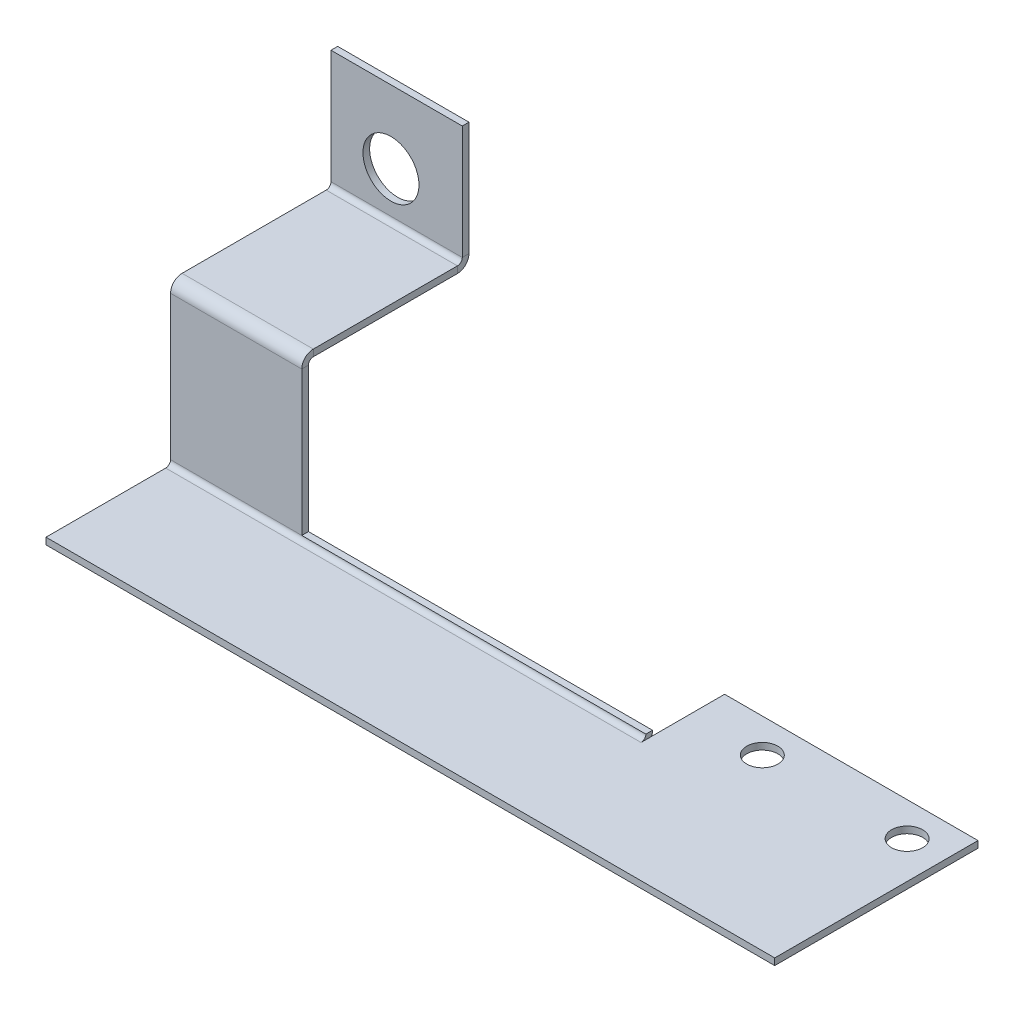
ISO-10303-21;
HEADER;
FILE_DESCRIPTION(('STEP AP214'),'2;1');
FILE_NAME('part.step','',(''),(''),'','','');
FILE_SCHEMA(('AUTOMOTIVE_DESIGN { 1 0 10303 214 1 1 1 1 }'));
ENDSEC;
DATA;
#1=APPLICATION_CONTEXT('core data for automotive mechanical design processes');
#2=APPLICATION_PROTOCOL_DEFINITION('international standard','automotive_design',2000,#1);
#3=PRODUCT_CONTEXT('',#1,'mechanical');
#4=PRODUCT('Part','Part','',(#3));
#5=PRODUCT_RELATED_PRODUCT_CATEGORY('part','',(#4));
#6=PRODUCT_DEFINITION_FORMATION('','',#4);
#7=PRODUCT_DEFINITION_CONTEXT('part definition',#1,'design');
#8=PRODUCT_DEFINITION('design','',#6,#7);
#9=PRODUCT_DEFINITION_SHAPE('','',#8);
#10=(LENGTH_UNIT() NAMED_UNIT(*) SI_UNIT(.MILLI.,.METRE.));
#11=(NAMED_UNIT(*) PLANE_ANGLE_UNIT() SI_UNIT($,.RADIAN.));
#12=(NAMED_UNIT(*) SI_UNIT($,.STERADIAN.) SOLID_ANGLE_UNIT());
#13=UNCERTAINTY_MEASURE_WITH_UNIT(LENGTH_MEASURE(1.E-05),#10,'distance_accuracy_value','');
#14=(GEOMETRIC_REPRESENTATION_CONTEXT(3) GLOBAL_UNCERTAINTY_ASSIGNED_CONTEXT((#13)) GLOBAL_UNIT_ASSIGNED_CONTEXT((#10,
#11,#12)) REPRESENTATION_CONTEXT('',''));
#15=CARTESIAN_POINT('',(0.,0.,0.));
#16=DIRECTION('',(0.,0.,1.));
#17=DIRECTION('',(1.,0.,0.));
#18=AXIS2_PLACEMENT_3D('',#15,#16,#17);
#19=CARTESIAN_POINT('',(-110.7186,0.736599999999986,-18.1864));
#20=DIRECTION('',(-1.,0.,0.));
#21=DIRECTION('',(0.,0.,-1.));
#22=AXIS2_PLACEMENT_3D('',#19,#20,#21);
#23=CYLINDRICAL_SURFACE('',#22,1.75260000000001);
#24=DIRECTION('',(-1.,0.,0.));
#25=VECTOR('',#24,1.);
#26=CARTESIAN_POINT('',(0.,0.736600000000004,-19.939));
#27=LINE('',#26,#25);
#28=CARTESIAN_POINT('',(-90.7796,0.736599999999991,-19.939));
#29=VERTEX_POINT('',#28);
#30=CARTESIAN_POINT('',(-38.49878,0.736600000000003,-19.939));
#31=VERTEX_POINT('',#30);
#32=EDGE_CURVE('E365',#29,#31,#27,.F.);
#33=ORIENTED_EDGE('',*,*,#32,.T.);
#34=CARTESIAN_POINT('',(-38.49878,0.736599999999991,-18.1864));
#35=DIRECTION('',(1.,0.,0.));
#36=DIRECTION('',(0.,0.,-1.));
#37=AXIS2_PLACEMENT_3D('',#34,#35,#36);
#38=CIRCLE('',#37,1.75260000000001);
#39=CARTESIAN_POINT('',(-38.49878,0.,-19.7766915455979));
#40=VERTEX_POINT('',#39);
#41=EDGE_CURVE('E115',#31,#40,#38,.F.);
#42=ORIENTED_EDGE('',*,*,#41,.T.);
#43=CARTESIAN_POINT('',(-38.49878,-1.01600000000001,-18.1864));
#44=VERTEX_POINT('',#43);
#45=EDGE_CURVE('E268',#40,#44,#38,.F.);
#46=ORIENTED_EDGE('',*,*,#45,.T.);
#47=DIRECTION('',(-1.,0.,0.));
#48=VECTOR('',#47,1.);
#49=CARTESIAN_POINT('',(-110.7186,-1.01600000000002,-18.1864));
#50=LINE('',#49,#48);
#51=CARTESIAN_POINT('',(-110.7186,-1.01600000000002,-18.1864));
#52=VERTEX_POINT('',#51);
#53=EDGE_CURVE('E395',#52,#44,#50,.F.);
#54=ORIENTED_EDGE('',*,*,#53,.F.);
#55=CARTESIAN_POINT('',(-110.7186,0.736599999999986,-18.1864));
#56=DIRECTION('',(-1.,0.,0.));
#57=DIRECTION('',(0.,-1.,0.));
#58=AXIS2_PLACEMENT_3D('',#55,#56,#57);
#59=CIRCLE('',#58,1.75260000000001);
#60=CARTESIAN_POINT('',(-110.7186,0.736600000000001,-19.939));
#61=VERTEX_POINT('',#60);
#62=EDGE_CURVE('E398',#61,#52,#59,.T.);
#63=ORIENTED_EDGE('',*,*,#62,.F.);
#64=DIRECTION('',(-1.,0.,0.));
#65=VECTOR('',#64,1.);
#66=CARTESIAN_POINT('',(0.,0.736600000000004,-19.939));
#67=LINE('',#66,#65);
#68=EDGE_CURVE('E387',#61,#29,#67,.F.);
#69=ORIENTED_EDGE('',*,*,#68,.T.);
#70=EDGE_LOOP('',(#33,#42,#46,#54,#63,#69));
#71=FACE_BOUND('',#70,.T.);
#72=ADVANCED_FACE('F98',(#71),#23,.T.);
#73=CARTESIAN_POINT('',(-110.7186,0.736599999999986,-18.1864));
#74=DIRECTION('',(-1.,0.,0.));
#75=DIRECTION('',(0.,0.,-1.));
#76=AXIS2_PLACEMENT_3D('',#73,#74,#75);
#77=CYLINDRICAL_SURFACE('',#76,0.736600000000007);
#78=CARTESIAN_POINT('',(-38.49878,0.736599999999991,-18.1864));
#79=DIRECTION('',(1.,0.,0.));
#80=DIRECTION('',(0.,0.,-1.));
#81=AXIS2_PLACEMENT_3D('',#78,#79,#80);
#82=CIRCLE('',#81,0.736600000000007);
#83=CARTESIAN_POINT('',(-38.49878,0.736599999999987,-18.923));
#84=VERTEX_POINT('',#83);
#85=CARTESIAN_POINT('',(-38.49878,0.,-18.1864));
#86=VERTEX_POINT('',#85);
#87=EDGE_CURVE('E265',#84,#86,#82,.F.);
#88=ORIENTED_EDGE('',*,*,#87,.F.);
#89=DIRECTION('',(-1.,0.,0.));
#90=VECTOR('',#89,1.);
#91=CARTESIAN_POINT('',(0.,0.736599999999997,-18.923));
#92=LINE('',#91,#90);
#93=CARTESIAN_POINT('',(-90.7796,0.736599999999991,-18.923));
#94=VERTEX_POINT('',#93);
#95=EDGE_CURVE('E393',#84,#94,#92,.T.);
#96=ORIENTED_EDGE('',*,*,#95,.T.);
#97=CARTESIAN_POINT('',(-110.7186,0.736599999999983,-18.923));
#98=VERTEX_POINT('',#97);
#99=EDGE_CURVE('E379',#94,#98,#92,.T.);
#100=ORIENTED_EDGE('',*,*,#99,.T.);
#101=CARTESIAN_POINT('',(-110.7186,0.736599999999986,-18.1864));
#102=DIRECTION('',(-1.,0.,0.));
#103=DIRECTION('',(0.,-1.,0.));
#104=AXIS2_PLACEMENT_3D('',#101,#102,#103);
#105=CIRCLE('',#104,0.736600000000007);
#106=CARTESIAN_POINT('',(-110.7186,0.,-18.1864));
#107=VERTEX_POINT('',#106);
#108=EDGE_CURVE('E383',#98,#107,#105,.T.);
#109=ORIENTED_EDGE('',*,*,#108,.T.);
#110=DIRECTION('',(-1.,0.,0.));
#111=VECTOR('',#110,1.);
#112=CARTESIAN_POINT('',(-110.7186,0.,-18.1864));
#113=LINE('',#112,#111);
#114=EDGE_CURVE('E401',#107,#86,#113,.F.);
#115=ORIENTED_EDGE('',*,*,#114,.T.);
#116=EDGE_LOOP('',(#88,#96,#100,#109,#115));
#117=FACE_BOUND('',#116,.T.);
#118=ADVANCED_FACE('F425',(#117),#77,.F.);
#119=CARTESIAN_POINT('',(0.,0.736599999999984,-19.9400000000001));
#120=DIRECTION('',(0.,-1.,0.));
#121=DIRECTION('',(1.,0.,0.));
#122=AXIS2_PLACEMENT_3D('',#119,#120,#121);
#123=PLANE('',#122);
#124=DIRECTION('',(0.,0.,1.));
#125=VECTOR('',#124,1.);
#126=CARTESIAN_POINT('',(-38.49878,0.736599999999987,-19.9400000000001));
#127=LINE('',#126,#125);
#128=EDGE_CURVE('E106',#31,#84,#127,.T.);
#129=ORIENTED_EDGE('',*,*,#128,.F.);
#130=ORIENTED_EDGE('',*,*,#32,.F.);
#131=DIRECTION('',(0.,0.,1.));
#132=VECTOR('',#131,1.);
#133=CARTESIAN_POINT('',(-90.7796,0.736599999999991,-19.9400000000001));
#134=LINE('',#133,#132);
#135=EDGE_CURVE('E376',#29,#94,#134,.T.);
#136=ORIENTED_EDGE('',*,*,#135,.T.);
#137=ORIENTED_EDGE('',*,*,#95,.F.);
#138=EDGE_LOOP('',(#129,#130,#136,#137));
#139=FACE_BOUND('',#138,.T.);
#140=ADVANCED_FACE('F426',(#139),#123,.F.);
#141=CARTESIAN_POINT('',(-110.7186,24.384,-19.9390000000001));
#142=DIRECTION('',(1.,0.,0.));
#143=DIRECTION('',(0.,1.,0.));
#144=AXIS2_PLACEMENT_3D('',#141,#142,#143);
#145=PLANE('',#144);
#146=DIRECTION('',(0.,-1.,0.));
#147=VECTOR('',#146,1.);
#148=CARTESIAN_POINT('',(-110.7186,24.384,-42.5704000000001));
#149=LINE('',#148,#147);
#150=CARTESIAN_POINT('',(-110.7186,24.384,-42.5704000000001));
#151=VERTEX_POINT('',#150);
#152=CARTESIAN_POINT('',(-110.7186,23.368,-42.5704000000001));
#153=VERTEX_POINT('',#152);
#154=EDGE_CURVE('E308',#151,#153,#149,.T.);
#155=ORIENTED_EDGE('',*,*,#154,.T.);
#156=DIRECTION('',(0.,0.,-1.));
#157=VECTOR('',#156,1.);
#158=CARTESIAN_POINT('',(-110.7186,23.368,-19.9390000000001));
#159=LINE('',#158,#157);
#160=CARTESIAN_POINT('',(-110.7186,23.368,-20.6756000000001));
#161=VERTEX_POINT('',#160);
#162=EDGE_CURVE('E333',#153,#161,#159,.F.);
#163=ORIENTED_EDGE('',*,*,#162,.T.);
#164=DIRECTION('',(0.,-1.,0.));
#165=VECTOR('',#164,1.);
#166=CARTESIAN_POINT('',(-110.7186,24.384,-20.6756000000001));
#167=LINE('',#166,#165);
#168=CARTESIAN_POINT('',(-110.7186,24.384,-20.6756000000001));
#169=VERTEX_POINT('',#168);
#170=EDGE_CURVE('E321',#161,#169,#167,.F.);
#171=ORIENTED_EDGE('',*,*,#170,.T.);
#172=DIRECTION('',(0.,0.,1.));
#173=VECTOR('',#172,1.);
#174=CARTESIAN_POINT('',(-110.7186,24.384,0.));
#175=LINE('',#174,#173);
#176=EDGE_CURVE('E328',#151,#169,#175,.T.);
#177=ORIENTED_EDGE('',*,*,#176,.F.);
#178=EDGE_LOOP('',(#155,#163,#171,#177));
#179=FACE_BOUND('',#178,.T.);
#180=ADVANCED_FACE('F599',(#179),#145,.F.);
#181=CARTESIAN_POINT('',(-90.7796,24.384,-44.3230000000001));
#182=DIRECTION('',(-1.,0.,0.));
#183=DIRECTION('',(0.,-1.,0.));
#184=AXIS2_PLACEMENT_3D('',#181,#182,#183);
#185=PLANE('',#184);
#186=DIRECTION('',(0.,-1.,0.));
#187=VECTOR('',#186,1.);
#188=CARTESIAN_POINT('',(-90.7796,24.384,-42.5704000000001));
#189=LINE('',#188,#187);
#190=CARTESIAN_POINT('',(-90.7796,24.384,-42.5704000000001));
#191=VERTEX_POINT('',#190);
#192=CARTESIAN_POINT('',(-90.7796,23.368,-42.5704000000001));
#193=VERTEX_POINT('',#192);
#194=EDGE_CURVE('E318',#191,#193,#189,.T.);
#195=ORIENTED_EDGE('',*,*,#194,.F.);
#196=DIRECTION('',(0.,0.,-1.));
#197=VECTOR('',#196,1.);
#198=CARTESIAN_POINT('',(-90.7796,24.384,0.));
#199=LINE('',#198,#197);
#200=CARTESIAN_POINT('',(-90.7796,24.384,-20.6756000000001));
#201=VERTEX_POINT('',#200);
#202=EDGE_CURVE('E324',#201,#191,#199,.T.);
#203=ORIENTED_EDGE('',*,*,#202,.F.);
#204=DIRECTION('',(0.,-1.,0.));
#205=VECTOR('',#204,1.);
#206=CARTESIAN_POINT('',(-90.7796,23.368,-20.6756000000001));
#207=LINE('',#206,#205);
#208=CARTESIAN_POINT('',(-90.7796,23.368,-20.6756000000001));
#209=VERTEX_POINT('',#208);
#210=EDGE_CURVE('E338',#209,#201,#207,.F.);
#211=ORIENTED_EDGE('',*,*,#210,.F.);
#212=DIRECTION('',(0.,0.,1.));
#213=VECTOR('',#212,1.);
#214=CARTESIAN_POINT('',(-90.7796,23.368,-44.3230000000001));
#215=LINE('',#214,#213);
#216=EDGE_CURVE('E330',#209,#193,#215,.F.);
#217=ORIENTED_EDGE('',*,*,#216,.T.);
#218=EDGE_LOOP('',(#195,#203,#211,#217));
#219=FACE_BOUND('',#218,.T.);
#220=ADVANCED_FACE('F662',(#219),#185,.F.);
#221=CARTESIAN_POINT('',(0.,24.384,0.));
#222=DIRECTION('',(0.,-1.,0.));
#223=DIRECTION('',(0.,0.,-1.));
#224=AXIS2_PLACEMENT_3D('',#221,#222,#223);
#225=PLANE('',#224);
#226=DIRECTION('',(-1.,0.,0.));
#227=VECTOR('',#226,1.);
#228=CARTESIAN_POINT('',(-110.7186,24.384,-42.5704000000001));
#229=LINE('',#228,#227);
#230=EDGE_CURVE('E314',#151,#191,#229,.F.);
#231=ORIENTED_EDGE('',*,*,#230,.F.);
#232=ORIENTED_EDGE('',*,*,#176,.T.);
#233=DIRECTION('',(1.,0.,0.));
#234=VECTOR('',#233,1.);
#235=CARTESIAN_POINT('',(-110.7186,24.384,-20.6756000000001));
#236=LINE('',#235,#234);
#237=EDGE_CURVE('E335',#201,#169,#236,.F.);
#238=ORIENTED_EDGE('',*,*,#237,.F.);
#239=ORIENTED_EDGE('',*,*,#202,.T.);
#240=EDGE_LOOP('',(#231,#232,#238,#239));
#241=FACE_BOUND('',#240,.T.);
#242=ADVANCED_FACE('F658',(#241),#225,.F.);
#243=CARTESIAN_POINT('',(0.,23.368,0.));
#244=DIRECTION('',(0.,-1.,0.));
#245=DIRECTION('',(0.,0.,-1.));
#246=AXIS2_PLACEMENT_3D('',#243,#244,#245);
#247=PLANE('',#246);
#248=ORIENTED_EDGE('',*,*,#162,.F.);
#249=DIRECTION('',(-1.,0.,0.));
#250=VECTOR('',#249,1.);
#251=CARTESIAN_POINT('',(-110.7186,23.368,-42.5704000000001));
#252=LINE('',#251,#250);
#253=EDGE_CURVE('E301',#153,#193,#252,.F.);
#254=ORIENTED_EDGE('',*,*,#253,.T.);
#255=ORIENTED_EDGE('',*,*,#216,.F.);
#256=DIRECTION('',(1.,0.,0.));
#257=VECTOR('',#256,1.);
#258=CARTESIAN_POINT('',(-110.7186,23.368,-20.6756000000001));
#259=LINE('',#258,#257);
#260=EDGE_CURVE('E341',#161,#209,#259,.T.);
#261=ORIENTED_EDGE('',*,*,#260,.F.);
#262=EDGE_LOOP('',(#248,#254,#255,#261));
#263=FACE_BOUND('',#262,.T.);
#264=ADVANCED_FACE('F661',(#263),#247,.T.);
#265=CARTESIAN_POINT('',(-110.7186,24.384,-19.9390000000001));
#266=DIRECTION('',(1.,0.,0.));
#267=DIRECTION('',(0.,0.,-1.));
#268=AXIS2_PLACEMENT_3D('',#265,#266,#267);
#269=PLANE('',#268);
#270=DIRECTION('',(0.,0.,1.));
#271=VECTOR('',#270,1.);
#272=CARTESIAN_POINT('',(-110.7186,22.6314,-19.9390000000001));
#273=LINE('',#272,#271);
#274=CARTESIAN_POINT('',(-110.7186,22.6314,-19.9390000000001));
#275=VERTEX_POINT('',#274);
#276=CARTESIAN_POINT('',(-110.7186,22.6314,-18.9230000000001));
#277=VERTEX_POINT('',#276);
#278=EDGE_CURVE('E362',#275,#277,#273,.T.);
#279=ORIENTED_EDGE('',*,*,#278,.F.);
#280=DIRECTION('',(0.,1.,0.));
#281=VECTOR('',#280,1.);
#282=CARTESIAN_POINT('',(-110.7186,0.,-19.939));
#283=LINE('',#282,#281);
#284=EDGE_CURVE('E380',#61,#275,#283,.T.);
#285=ORIENTED_EDGE('',*,*,#284,.F.);
#286=DIRECTION('',(0.,0.,1.));
#287=VECTOR('',#286,1.);
#288=CARTESIAN_POINT('',(-110.7186,0.736599999999993,-18.923));
#289=LINE('',#288,#287);
#290=EDGE_CURVE('E390',#98,#61,#289,.F.);
#291=ORIENTED_EDGE('',*,*,#290,.F.);
#292=DIRECTION('',(0.,-1.,0.));
#293=VECTOR('',#292,1.);
#294=CARTESIAN_POINT('',(-110.7186,24.384,-18.9230000000001));
#295=LINE('',#294,#293);
#296=EDGE_CURVE('E384',#98,#277,#295,.F.);
#297=ORIENTED_EDGE('',*,*,#296,.T.);
#298=EDGE_LOOP('',(#279,#285,#291,#297));
#299=FACE_BOUND('',#298,.T.);
#300=ADVANCED_FACE('F443',(#299),#269,.F.);
#301=CARTESIAN_POINT('',(0.,0.,-19.939));
#302=DIRECTION('',(0.,0.,1.));
#303=DIRECTION('',(0.,-1.,0.));
#304=AXIS2_PLACEMENT_3D('',#301,#302,#303);
#305=PLANE('',#304);
#306=DIRECTION('',(1.,0.,0.));
#307=VECTOR('',#306,1.);
#308=CARTESIAN_POINT('',(-90.7796,22.6314,-19.9390000000001));
#309=LINE('',#308,#307);
#310=CARTESIAN_POINT('',(-90.7796,22.6314,-19.9390000000001));
#311=VERTEX_POINT('',#310);
#312=EDGE_CURVE('E358',#311,#275,#309,.F.);
#313=ORIENTED_EDGE('',*,*,#312,.F.);
#314=DIRECTION('',(0.,1.,0.));
#315=VECTOR('',#314,1.);
#316=CARTESIAN_POINT('',(-90.7796,24.384,-19.9390000000001));
#317=LINE('',#316,#315);
#318=EDGE_CURVE('E370',#29,#311,#317,.T.);
#319=ORIENTED_EDGE('',*,*,#318,.F.);
#320=ORIENTED_EDGE('',*,*,#68,.F.);
#321=ORIENTED_EDGE('',*,*,#284,.T.);
#322=EDGE_LOOP('',(#313,#319,#320,#321));
#323=FACE_BOUND('',#322,.T.);
#324=ADVANCED_FACE('F446',(#323),#305,.F.);
#325=CARTESIAN_POINT('',(0.,0.,-18.923));
#326=DIRECTION('',(0.,0.,1.));
#327=DIRECTION('',(0.,-1.,0.));
#328=AXIS2_PLACEMENT_3D('',#325,#326,#327);
#329=PLANE('',#328);
#330=DIRECTION('',(0.,-1.,0.));
#331=VECTOR('',#330,1.);
#332=CARTESIAN_POINT('',(-90.7796,24.384,-18.923));
#333=LINE('',#332,#331);
#334=CARTESIAN_POINT('',(-90.7796,22.6314,-18.9230000000001));
#335=VERTEX_POINT('',#334);
#336=EDGE_CURVE('E373',#335,#94,#333,.T.);
#337=ORIENTED_EDGE('',*,*,#336,.F.);
#338=DIRECTION('',(1.,0.,0.));
#339=VECTOR('',#338,1.);
#340=CARTESIAN_POINT('',(-90.7796,22.6314,-18.9230000000001));
#341=LINE('',#340,#339);
#342=EDGE_CURVE('E345',#335,#277,#341,.F.);
#343=ORIENTED_EDGE('',*,*,#342,.T.);
#344=ORIENTED_EDGE('',*,*,#296,.F.);
#345=ORIENTED_EDGE('',*,*,#99,.F.);
#346=EDGE_LOOP('',(#337,#343,#344,#345));
#347=FACE_BOUND('',#346,.T.);
#348=ADVANCED_FACE('F433',(#347),#329,.T.);
#349=CARTESIAN_POINT('',(-90.7796,24.384,-19.9400000000001));
#350=DIRECTION('',(-1.,0.,0.));
#351=DIRECTION('',(0.,0.,1.));
#352=AXIS2_PLACEMENT_3D('',#349,#350,#351);
#353=PLANE('',#352);
#354=DIRECTION('',(0.,0.,1.));
#355=VECTOR('',#354,1.);
#356=CARTESIAN_POINT('',(-90.7796,22.6314,-19.9390000000001));
#357=LINE('',#356,#355);
#358=EDGE_CURVE('E352',#311,#335,#357,.T.);
#359=ORIENTED_EDGE('',*,*,#358,.T.);
#360=ORIENTED_EDGE('',*,*,#336,.T.);
#361=ORIENTED_EDGE('',*,*,#135,.F.);
#362=ORIENTED_EDGE('',*,*,#318,.T.);
#363=EDGE_LOOP('',(#359,#360,#361,#362));
#364=FACE_BOUND('',#363,.T.);
#365=ADVANCED_FACE('F463',(#364),#353,.F.);
#366=CARTESIAN_POINT('',(-110.7186,-1.016,0.));
#367=DIRECTION('',(-1.,0.,0.));
#368=DIRECTION('',(0.,0.,1.));
#369=AXIS2_PLACEMENT_3D('',#366,#367,#368);
#370=PLANE('',#369);
#371=DIRECTION('',(0.,0.,1.));
#372=VECTOR('',#371,1.);
#373=CARTESIAN_POINT('',(-110.7186,0.,0.));
#374=LINE('',#373,#372);
#375=CARTESIAN_POINT('',(-110.7186,0.,0.));
#376=VERTEX_POINT('',#375);
#377=EDGE_CURVE('E413',#107,#376,#374,.T.);
#378=ORIENTED_EDGE('',*,*,#377,.F.);
#379=DIRECTION('',(0.,-1.,0.));
#380=VECTOR('',#379,1.);
#381=CARTESIAN_POINT('',(-110.7186,0.,-18.1864));
#382=LINE('',#381,#380);
#383=EDGE_CURVE('E397',#107,#52,#382,.T.);
#384=ORIENTED_EDGE('',*,*,#383,.T.);
#385=DIRECTION('',(0.,0.,1.));
#386=VECTOR('',#385,1.);
#387=CARTESIAN_POINT('',(-110.7186,-1.016,0.));
#388=LINE('',#387,#386);
#389=CARTESIAN_POINT('',(-110.7186,-1.016,0.));
#390=VERTEX_POINT('',#389);
#391=EDGE_CURVE('E239',#52,#390,#388,.T.);
#392=ORIENTED_EDGE('',*,*,#391,.T.);
#393=DIRECTION('',(0.,1.,0.));
#394=VECTOR('',#393,1.);
#395=CARTESIAN_POINT('',(-110.7186,-1.016,0.));
#396=LINE('',#395,#394);
#397=EDGE_CURVE('E411',#390,#376,#396,.T.);
#398=ORIENTED_EDGE('',*,*,#397,.T.);
#399=EDGE_LOOP('',(#378,#384,#392,#398));
#400=FACE_BOUND('',#399,.T.);
#401=ADVANCED_FACE('F461',(#400),#370,.T.);
#402=CARTESIAN_POINT('',(0.,-1.016,0.));
#403=DIRECTION('',(0.,1.,0.));
#404=DIRECTION('',(0.,0.,1.));
#405=AXIS2_PLACEMENT_3D('',#402,#403,#404);
#406=PLANE('',#405);
#407=CARTESIAN_POINT('',(-5.62609999999999,-1.016,-25.7428999999999));
#408=DIRECTION('',(0.,1.,0.));
#409=DIRECTION('',(0.,0.,1.));
#410=AXIS2_PLACEMENT_3D('',#407,#408,#409);
#411=CIRCLE('',#410,2.36295847969752);
#412=CARTESIAN_POINT('',(-5.62609999999999,-1.016,-23.3799415203024));
#413=VERTEX_POINT('',#412);
#414=EDGE_CURVE('E901',#413,#413,#411,.F.);
#415=ORIENTED_EDGE('',*,*,#414,.F.);
#416=EDGE_LOOP('',(#415));
#417=FACE_BOUND('',#416,.T.);
#418=CARTESIAN_POINT('',(-27.6261,-1.016,-25.7428999999999));
#419=DIRECTION('',(0.,1.,0.));
#420=DIRECTION('',(0.,0.,1.));
#421=AXIS2_PLACEMENT_3D('',#418,#419,#420);
#422=CIRCLE('',#421,2.3629584796971);
#423=CARTESIAN_POINT('',(-27.6261,-1.016,-23.3799415203028));
#424=VERTEX_POINT('',#423);
#425=EDGE_CURVE('E905',#424,#424,#422,.F.);
#426=ORIENTED_EDGE('',*,*,#425,.F.);
#427=EDGE_LOOP('',(#426));
#428=FACE_BOUND('',#427,.T.);
#429=ORIENTED_EDGE('',*,*,#53,.T.);
#430=DIRECTION('',(0.,0.,1.));
#431=VECTOR('',#430,1.);
#432=CARTESIAN_POINT('',(-38.49878,-1.016,-18.1864));
#433=LINE('',#432,#431);
#434=CARTESIAN_POINT('',(-38.49878,-1.016,-30.8864));
#435=VERTEX_POINT('',#434);
#436=EDGE_CURVE('E249',#435,#44,#433,.T.);
#437=ORIENTED_EDGE('',*,*,#436,.F.);
#438=DIRECTION('',(-1.,0.,0.));
#439=VECTOR('',#438,1.);
#440=CARTESIAN_POINT('',(0.,-1.016,-30.8864));
#441=LINE('',#440,#439);
#442=CARTESIAN_POINT('',(0.,-1.016,-30.8864));
#443=VERTEX_POINT('',#442);
#444=EDGE_CURVE('E245',#443,#435,#441,.T.);
#445=ORIENTED_EDGE('',*,*,#444,.F.);
#446=DIRECTION('',(0.,0.,-1.));
#447=VECTOR('',#446,1.);
#448=CARTESIAN_POINT('',(0.,-1.016,0.));
#449=LINE('',#448,#447);
#450=CARTESIAN_POINT('',(0.,-1.016,0.));
#451=VERTEX_POINT('',#450);
#452=EDGE_CURVE('E229',#451,#443,#449,.T.);
#453=ORIENTED_EDGE('',*,*,#452,.F.);
#454=DIRECTION('',(1.,0.,0.));
#455=VECTOR('',#454,1.);
#456=CARTESIAN_POINT('',(0.,-1.016,0.));
#457=LINE('',#456,#455);
#458=EDGE_CURVE('E409',#390,#451,#457,.T.);
#459=ORIENTED_EDGE('',*,*,#458,.F.);
#460=ORIENTED_EDGE('',*,*,#391,.F.);
#461=EDGE_LOOP('',(#429,#437,#445,#453,#459,#460));
#462=FACE_BOUND('',#461,.T.);
#463=ADVANCED_FACE('F253',(#417,#428,#462),#406,.F.);
#464=CARTESIAN_POINT('',(0.,0.,0.));
#465=DIRECTION('',(0.,1.,0.));
#466=DIRECTION('',(0.,0.,1.));
#467=AXIS2_PLACEMENT_3D('',#464,#465,#466);
#468=PLANE('',#467);
#469=CARTESIAN_POINT('',(-5.62609999999999,0.,-25.7428999999999));
#470=DIRECTION('',(0.,1.,0.));
#471=DIRECTION('',(0.,0.,1.));
#472=AXIS2_PLACEMENT_3D('',#469,#470,#471);
#473=CIRCLE('',#472,2.36295847969752);
#474=CARTESIAN_POINT('',(-5.62609999999999,0.,-23.3799415203024));
#475=VERTEX_POINT('',#474);
#476=EDGE_CURVE('E898',#475,#475,#473,.T.);
#477=ORIENTED_EDGE('',*,*,#476,.F.);
#478=EDGE_LOOP('',(#477));
#479=FACE_BOUND('',#478,.T.);
#480=CARTESIAN_POINT('',(-27.6261,0.,-25.7428999999999));
#481=DIRECTION('',(0.,1.,0.));
#482=DIRECTION('',(0.,0.,1.));
#483=AXIS2_PLACEMENT_3D('',#480,#481,#482);
#484=CIRCLE('',#483,2.3629584796971);
#485=CARTESIAN_POINT('',(-27.6261,0.,-23.3799415203028));
#486=VERTEX_POINT('',#485);
#487=EDGE_CURVE('E902',#486,#486,#484,.T.);
#488=ORIENTED_EDGE('',*,*,#487,.F.);
#489=EDGE_LOOP('',(#488));
#490=FACE_BOUND('',#489,.T.);
#491=DIRECTION('',(0.,0.,-1.));
#492=VECTOR('',#491,1.);
#493=CARTESIAN_POINT('',(0.,0.,0.));
#494=LINE('',#493,#492);
#495=CARTESIAN_POINT('',(0.,0.,0.));
#496=VERTEX_POINT('',#495);
#497=CARTESIAN_POINT('',(0.,0.,-30.8864));
#498=VERTEX_POINT('',#497);
#499=EDGE_CURVE('E406',#496,#498,#494,.T.);
#500=ORIENTED_EDGE('',*,*,#499,.T.);
#501=DIRECTION('',(-1.,0.,0.));
#502=VECTOR('',#501,1.);
#503=CARTESIAN_POINT('',(0.,0.,-30.8864));
#504=LINE('',#503,#502);
#505=CARTESIAN_POINT('',(-38.49878,0.,-30.8864));
#506=VERTEX_POINT('',#505);
#507=EDGE_CURVE('E247',#498,#506,#504,.T.);
#508=ORIENTED_EDGE('',*,*,#507,.T.);
#509=DIRECTION('',(0.,0.,1.));
#510=VECTOR('',#509,1.);
#511=CARTESIAN_POINT('',(-38.49878,0.,-18.1864));
#512=LINE('',#511,#510);
#513=EDGE_CURVE('E255',#506,#40,#512,.T.);
#514=ORIENTED_EDGE('',*,*,#513,.T.);
#515=DIRECTION('',(0.,0.,1.));
#516=VECTOR('',#515,1.);
#517=CARTESIAN_POINT('',(-38.49878,0.,-18.1864));
#518=LINE('',#517,#516);
#519=EDGE_CURVE('E13',#40,#86,#518,.T.);
#520=ORIENTED_EDGE('',*,*,#519,.T.);
#521=ORIENTED_EDGE('',*,*,#114,.F.);
#522=ORIENTED_EDGE('',*,*,#377,.T.);
#523=DIRECTION('',(1.,0.,0.));
#524=VECTOR('',#523,1.);
#525=CARTESIAN_POINT('',(0.,0.,0.));
#526=LINE('',#525,#524);
#527=EDGE_CURVE('E240',#376,#496,#526,.T.);
#528=ORIENTED_EDGE('',*,*,#527,.T.);
#529=EDGE_LOOP('',(#500,#508,#514,#520,#521,#522,#528));
#530=FACE_BOUND('',#529,.T.);
#531=ADVANCED_FACE('F454',(#479,#490,#530),#468,.T.);
#532=CARTESIAN_POINT('',(0.,-1.016,0.));
#533=DIRECTION('',(1.,0.,0.));
#534=DIRECTION('',(0.,0.,-1.));
#535=AXIS2_PLACEMENT_3D('',#532,#533,#534);
#536=PLANE('',#535);
#537=ORIENTED_EDGE('',*,*,#452,.T.);
#538=DIRECTION('',(0.,1.,0.));
#539=VECTOR('',#538,1.);
#540=CARTESIAN_POINT('',(0.,-1.016,-30.8864));
#541=LINE('',#540,#539);
#542=EDGE_CURVE('E232',#443,#498,#541,.T.);
#543=ORIENTED_EDGE('',*,*,#542,.T.);
#544=ORIENTED_EDGE('',*,*,#499,.F.);
#545=DIRECTION('',(0.,1.,0.));
#546=VECTOR('',#545,1.);
#547=CARTESIAN_POINT('',(0.,-1.016,0.));
#548=LINE('',#547,#546);
#549=EDGE_CURVE('E234',#451,#496,#548,.T.);
#550=ORIENTED_EDGE('',*,*,#549,.F.);
#551=EDGE_LOOP('',(#537,#543,#544,#550));
#552=FACE_BOUND('',#551,.T.);
#553=ADVANCED_FACE('F100',(#552),#536,.T.);
#554=CARTESIAN_POINT('',(0.,-1.016,0.));
#555=DIRECTION('',(0.,0.,1.));
#556=DIRECTION('',(1.,0.,0.));
#557=AXIS2_PLACEMENT_3D('',#554,#555,#556);
#558=PLANE('',#557);
#559=ORIENTED_EDGE('',*,*,#527,.F.);
#560=ORIENTED_EDGE('',*,*,#397,.F.);
#561=ORIENTED_EDGE('',*,*,#458,.T.);
#562=ORIENTED_EDGE('',*,*,#549,.T.);
#563=EDGE_LOOP('',(#559,#560,#561,#562));
#564=FACE_BOUND('',#563,.T.);
#565=ADVANCED_FACE('F459',(#564),#558,.T.);
#566=CARTESIAN_POINT('',(-110.7186,0.736599999999986,-18.1864));
#567=DIRECTION('',(1.,0.,0.));
#568=DIRECTION('',(0.,1.,0.));
#569=AXIS2_PLACEMENT_3D('',#566,#567,#568);
#570=PLANE('',#569);
#571=ORIENTED_EDGE('',*,*,#108,.F.);
#572=ORIENTED_EDGE('',*,*,#290,.T.);
#573=ORIENTED_EDGE('',*,*,#62,.T.);
#574=ORIENTED_EDGE('',*,*,#383,.F.);
#575=EDGE_LOOP('',(#571,#572,#573,#574));
#576=FACE_BOUND('',#575,.T.);
#577=ADVANCED_FACE('F438',(#576),#570,.F.);
#578=CARTESIAN_POINT('',(-110.7186,22.6314,-20.6756000000001));
#579=DIRECTION('',(-1.,0.,0.));
#580=DIRECTION('',(0.,0.,1.));
#581=AXIS2_PLACEMENT_3D('',#578,#579,#580);
#582=PLANE('',#581);
#583=ORIENTED_EDGE('',*,*,#170,.F.);
#584=CARTESIAN_POINT('',(-110.7186,22.6314,-20.6756000000001));
#585=DIRECTION('',(1.,0.,0.));
#586=DIRECTION('',(0.,0.,-1.));
#587=AXIS2_PLACEMENT_3D('',#584,#585,#586);
#588=CIRCLE('',#587,0.7366);
#589=EDGE_CURVE('E355',#275,#161,#588,.F.);
#590=ORIENTED_EDGE('',*,*,#589,.F.);
#591=ORIENTED_EDGE('',*,*,#278,.T.);
#592=CARTESIAN_POINT('',(-110.7186,22.6314,-20.6756000000001));
#593=DIRECTION('',(1.,0.,0.));
#594=DIRECTION('',(0.,0.,-1.));
#595=AXIS2_PLACEMENT_3D('',#592,#593,#594);
#596=CIRCLE('',#595,1.7526);
#597=EDGE_CURVE('E348',#277,#169,#596,.F.);
#598=ORIENTED_EDGE('',*,*,#597,.T.);
#599=EDGE_LOOP('',(#583,#590,#591,#598));
#600=FACE_BOUND('',#599,.T.);
#601=ADVANCED_FACE('F482',(#600),#582,.T.);
#602=CARTESIAN_POINT('',(-90.7796,22.6314,-20.6756000000001));
#603=DIRECTION('',(-1.,0.,0.));
#604=DIRECTION('',(0.,0.,1.));
#605=AXIS2_PLACEMENT_3D('',#602,#603,#604);
#606=PLANE('',#605);
#607=CARTESIAN_POINT('',(-90.7796,22.6314,-20.6756000000001));
#608=DIRECTION('',(1.,0.,0.));
#609=DIRECTION('',(0.,0.,-1.));
#610=AXIS2_PLACEMENT_3D('',#607,#608,#609);
#611=CIRCLE('',#610,0.7366);
#612=EDGE_CURVE('E327',#209,#311,#611,.T.);
#613=ORIENTED_EDGE('',*,*,#612,.F.);
#614=ORIENTED_EDGE('',*,*,#210,.T.);
#615=CARTESIAN_POINT('',(-90.7796,22.6314,-20.6756000000001));
#616=DIRECTION('',(1.,0.,0.));
#617=DIRECTION('',(0.,0.,-1.));
#618=AXIS2_PLACEMENT_3D('',#615,#616,#617);
#619=CIRCLE('',#618,1.7526);
#620=EDGE_CURVE('E349',#201,#335,#619,.T.);
#621=ORIENTED_EDGE('',*,*,#620,.T.);
#622=ORIENTED_EDGE('',*,*,#358,.F.);
#623=EDGE_LOOP('',(#613,#614,#621,#622));
#624=FACE_BOUND('',#623,.T.);
#625=ADVANCED_FACE('F675',(#624),#606,.F.);
#626=CARTESIAN_POINT('',(-90.7796,22.6314,-20.6756000000001));
#627=DIRECTION('',(1.,0.,0.));
#628=DIRECTION('',(0.,1.,0.));
#629=AXIS2_PLACEMENT_3D('',#626,#627,#628);
#630=CYLINDRICAL_SURFACE('',#629,1.7526);
#631=ORIENTED_EDGE('',*,*,#342,.F.);
#632=ORIENTED_EDGE('',*,*,#620,.F.);
#633=ORIENTED_EDGE('',*,*,#237,.T.);
#634=ORIENTED_EDGE('',*,*,#597,.F.);
#635=EDGE_LOOP('',(#631,#632,#633,#634));
#636=FACE_BOUND('',#635,.T.);
#637=ADVANCED_FACE('F672',(#636),#630,.T.);
#638=CARTESIAN_POINT('',(-90.7796,22.6314,-20.6756000000001));
#639=DIRECTION('',(1.,0.,0.));
#640=DIRECTION('',(0.,1.,0.));
#641=AXIS2_PLACEMENT_3D('',#638,#639,#640);
#642=CYLINDRICAL_SURFACE('',#641,0.7366);
#643=ORIENTED_EDGE('',*,*,#312,.T.);
#644=ORIENTED_EDGE('',*,*,#589,.T.);
#645=ORIENTED_EDGE('',*,*,#260,.T.);
#646=ORIENTED_EDGE('',*,*,#612,.T.);
#647=EDGE_LOOP('',(#643,#644,#645,#646));
#648=FACE_BOUND('',#647,.T.);
#649=ADVANCED_FACE('F653',(#648),#642,.F.);
#650=CARTESIAN_POINT('',(-90.7796,25.1206,-42.5704000000001));
#651=DIRECTION('',(1.,0.,0.));
#652=DIRECTION('',(0.,0.,-1.));
#653=AXIS2_PLACEMENT_3D('',#650,#651,#652);
#654=PLANE('',#653);
#655=DIRECTION('',(0.,0.,1.));
#656=VECTOR('',#655,1.);
#657=CARTESIAN_POINT('',(-90.7796,25.1206,-44.3230000000001));
#658=LINE('',#657,#656);
#659=CARTESIAN_POINT('',(-90.7796,25.1206,-43.3070000000001));
#660=VERTEX_POINT('',#659);
#661=CARTESIAN_POINT('',(-90.7796,25.1206,-44.3230000000001));
#662=VERTEX_POINT('',#661);
#663=EDGE_CURVE('E270',#660,#662,#658,.F.);
#664=ORIENTED_EDGE('',*,*,#663,.F.);
#665=CARTESIAN_POINT('',(-90.7796,25.1206,-42.5704000000001));
#666=DIRECTION('',(-1.,0.,0.));
#667=DIRECTION('',(0.,0.,1.));
#668=AXIS2_PLACEMENT_3D('',#665,#666,#667);
#669=CIRCLE('',#668,0.736599999999997);
#670=EDGE_CURVE('E311',#191,#660,#669,.F.);
#671=ORIENTED_EDGE('',*,*,#670,.F.);
#672=ORIENTED_EDGE('',*,*,#194,.T.);
#673=CARTESIAN_POINT('',(-90.7796,25.1206,-42.5704000000001));
#674=DIRECTION('',(-1.,0.,0.));
#675=DIRECTION('',(0.,0.,1.));
#676=AXIS2_PLACEMENT_3D('',#673,#674,#675);
#677=CIRCLE('',#676,1.7526);
#678=EDGE_CURVE('E304',#193,#662,#677,.F.);
#679=ORIENTED_EDGE('',*,*,#678,.T.);
#680=EDGE_LOOP('',(#664,#671,#672,#679));
#681=FACE_BOUND('',#680,.T.);
#682=ADVANCED_FACE('F650',(#681),#654,.T.);
#683=CARTESIAN_POINT('',(-110.7186,25.1206,-42.5704000000001));
#684=DIRECTION('',(1.,0.,0.));
#685=DIRECTION('',(0.,0.,-1.));
#686=AXIS2_PLACEMENT_3D('',#683,#684,#685);
#687=PLANE('',#686);
#688=CARTESIAN_POINT('',(-110.7186,25.1206,-42.5704000000001));
#689=DIRECTION('',(-1.,0.,0.));
#690=DIRECTION('',(0.,0.,1.));
#691=AXIS2_PLACEMENT_3D('',#688,#689,#690);
#692=CIRCLE('',#691,0.736599999999997);
#693=CARTESIAN_POINT('',(-110.7186,25.1206,-43.3070000000001));
#694=VERTEX_POINT('',#693);
#695=EDGE_CURVE('E274',#694,#151,#692,.T.);
#696=ORIENTED_EDGE('',*,*,#695,.F.);
#697=DIRECTION('',(0.,0.,1.));
#698=VECTOR('',#697,1.);
#699=CARTESIAN_POINT('',(-110.7186,25.1206,-43.3070000000001));
#700=LINE('',#699,#698);
#701=CARTESIAN_POINT('',(-110.7186,25.1206,-44.3230000000001));
#702=VERTEX_POINT('',#701);
#703=EDGE_CURVE('E294',#694,#702,#700,.F.);
#704=ORIENTED_EDGE('',*,*,#703,.T.);
#705=CARTESIAN_POINT('',(-110.7186,25.1206,-42.5704000000001));
#706=DIRECTION('',(-1.,0.,0.));
#707=DIRECTION('',(0.,0.,1.));
#708=AXIS2_PLACEMENT_3D('',#705,#706,#707);
#709=CIRCLE('',#708,1.7526);
#710=EDGE_CURVE('E305',#702,#153,#709,.T.);
#711=ORIENTED_EDGE('',*,*,#710,.T.);
#712=ORIENTED_EDGE('',*,*,#154,.F.);
#713=EDGE_LOOP('',(#696,#704,#711,#712));
#714=FACE_BOUND('',#713,.T.);
#715=ADVANCED_FACE('F645',(#714),#687,.F.);
#716=CARTESIAN_POINT('',(-110.7186,25.1206,-42.5704000000001));
#717=DIRECTION('',(-1.,0.,0.));
#718=DIRECTION('',(0.,0.,-1.));
#719=AXIS2_PLACEMENT_3D('',#716,#717,#718);
#720=CYLINDRICAL_SURFACE('',#719,1.7526);
#721=ORIENTED_EDGE('',*,*,#253,.F.);
#722=ORIENTED_EDGE('',*,*,#710,.F.);
#723=DIRECTION('',(-1.,0.,0.));
#724=VECTOR('',#723,1.);
#725=CARTESIAN_POINT('',(-90.7796,25.1206,-44.3230000000001));
#726=LINE('',#725,#724);
#727=EDGE_CURVE('E292',#702,#662,#726,.F.);
#728=ORIENTED_EDGE('',*,*,#727,.T.);
#729=ORIENTED_EDGE('',*,*,#678,.F.);
#730=EDGE_LOOP('',(#721,#722,#728,#729));
#731=FACE_BOUND('',#730,.T.);
#732=ADVANCED_FACE('F642',(#731),#720,.T.);
#733=CARTESIAN_POINT('',(-110.7186,25.1206,-42.5704000000001));
#734=DIRECTION('',(-1.,0.,0.));
#735=DIRECTION('',(0.,0.,-1.));
#736=AXIS2_PLACEMENT_3D('',#733,#734,#735);
#737=CYLINDRICAL_SURFACE('',#736,0.736599999999997);
#738=ORIENTED_EDGE('',*,*,#230,.T.);
#739=ORIENTED_EDGE('',*,*,#670,.T.);
#740=DIRECTION('',(-1.,0.,0.));
#741=VECTOR('',#740,1.);
#742=CARTESIAN_POINT('',(-90.7796,25.1206,-43.3070000000001));
#743=LINE('',#742,#741);
#744=EDGE_CURVE('E297',#660,#694,#743,.T.);
#745=ORIENTED_EDGE('',*,*,#744,.T.);
#746=ORIENTED_EDGE('',*,*,#695,.T.);
#747=EDGE_LOOP('',(#738,#739,#745,#746));
#748=FACE_BOUND('',#747,.T.);
#749=ADVANCED_FACE('F640',(#748),#737,.F.);
#750=CARTESIAN_POINT('',(-90.7796,24.384,-44.3230000000001));
#751=DIRECTION('',(-1.,0.,0.));
#752=DIRECTION('',(0.,-1.,0.));
#753=AXIS2_PLACEMENT_3D('',#750,#751,#752);
#754=PLANE('',#753);
#755=ORIENTED_EDGE('',*,*,#663,.T.);
#756=DIRECTION('',(0.,-1.,0.));
#757=VECTOR('',#756,1.);
#758=CARTESIAN_POINT('',(-90.7796,-2.43945812995631E-13,-44.323));
#759=LINE('',#758,#757);
#760=CARTESIAN_POINT('',(-90.7796,42.418,-44.3230000000001));
#761=VERTEX_POINT('',#760);
#762=EDGE_CURVE('E282',#761,#662,#759,.T.);
#763=ORIENTED_EDGE('',*,*,#762,.F.);
#764=DIRECTION('',(0.,0.,1.));
#765=VECTOR('',#764,1.);
#766=CARTESIAN_POINT('',(-90.7796,42.418,-44.3230000000001));
#767=LINE('',#766,#765);
#768=CARTESIAN_POINT('',(-90.7796,42.418,-43.3070000000001));
#769=VERTEX_POINT('',#768);
#770=EDGE_CURVE('E275',#761,#769,#767,.T.);
#771=ORIENTED_EDGE('',*,*,#770,.T.);
#772=DIRECTION('',(0.,1.,0.));
#773=VECTOR('',#772,1.);
#774=CARTESIAN_POINT('',(-90.7796,24.384,-43.3070000000001));
#775=LINE('',#774,#773);
#776=EDGE_CURVE('E289',#769,#660,#775,.F.);
#777=ORIENTED_EDGE('',*,*,#776,.T.);
#778=EDGE_LOOP('',(#755,#763,#771,#777));
#779=FACE_BOUND('',#778,.T.);
#780=ADVANCED_FACE('F636',(#779),#754,.F.);
#781=CARTESIAN_POINT('',(-110.7186,42.418,-44.3230000000001));
#782=DIRECTION('',(1.,0.,0.));
#783=DIRECTION('',(0.,1.,0.));
#784=AXIS2_PLACEMENT_3D('',#781,#782,#783);
#785=PLANE('',#784);
#786=ORIENTED_EDGE('',*,*,#703,.F.);
#787=DIRECTION('',(0.,-1.,0.));
#788=VECTOR('',#787,1.);
#789=CARTESIAN_POINT('',(-110.7186,42.418,-43.3070000000001));
#790=LINE('',#789,#788);
#791=CARTESIAN_POINT('',(-110.7186,42.418,-43.3070000000001));
#792=VERTEX_POINT('',#791);
#793=EDGE_CURVE('E287',#694,#792,#790,.F.);
#794=ORIENTED_EDGE('',*,*,#793,.T.);
#795=DIRECTION('',(0.,0.,1.));
#796=VECTOR('',#795,1.);
#797=CARTESIAN_POINT('',(-110.7186,42.418,-44.3230000000001));
#798=LINE('',#797,#796);
#799=CARTESIAN_POINT('',(-110.7186,42.418,-44.3230000000001));
#800=VERTEX_POINT('',#799);
#801=EDGE_CURVE('E271',#800,#792,#798,.T.);
#802=ORIENTED_EDGE('',*,*,#801,.F.);
#803=DIRECTION('',(0.,1.,0.));
#804=VECTOR('',#803,1.);
#805=CARTESIAN_POINT('',(-110.7186,-2.59289564304271E-13,-44.323));
#806=LINE('',#805,#804);
#807=EDGE_CURVE('E280',#702,#800,#806,.T.);
#808=ORIENTED_EDGE('',*,*,#807,.F.);
#809=EDGE_LOOP('',(#786,#794,#802,#808));
#810=FACE_BOUND('',#809,.T.);
#811=ADVANCED_FACE('F544',(#810),#785,.F.);
#812=CARTESIAN_POINT('',(0.,-1.74087765636294E-13,-44.323));
#813=DIRECTION('',(0.,0.,1.));
#814=DIRECTION('',(0.,-1.,0.));
#815=AXIS2_PLACEMENT_3D('',#812,#813,#814);
#816=PLANE('',#815);
#817=CARTESIAN_POINT('',(-101.616099999999,31.3689302241909,-44.3230000000001));
#818=DIRECTION('',(0.,0.,1.));
#819=DIRECTION('',(0.,-1.,0.));
#820=AXIS2_PLACEMENT_3D('',#817,#818,#819);
#821=CIRCLE('',#820,4.25449999999791);
#822=CARTESIAN_POINT('',(-101.616099999999,27.114430224193,-44.3230000000001));
#823=VERTEX_POINT('',#822);
#824=EDGE_CURVE('E261',#823,#823,#821,.F.);
#825=ORIENTED_EDGE('',*,*,#824,.F.);
#826=EDGE_LOOP('',(#825));
#827=FACE_BOUND('',#826,.T.);
#828=ORIENTED_EDGE('',*,*,#727,.F.);
#829=ORIENTED_EDGE('',*,*,#807,.T.);
#830=DIRECTION('',(1.,0.,0.));
#831=VECTOR('',#830,1.);
#832=CARTESIAN_POINT('',(0.,42.418,-44.3230000000002));
#833=LINE('',#832,#831);
#834=EDGE_CURVE('E278',#800,#761,#833,.T.);
#835=ORIENTED_EDGE('',*,*,#834,.T.);
#836=ORIENTED_EDGE('',*,*,#762,.T.);
#837=EDGE_LOOP('',(#828,#829,#835,#836));
#838=FACE_BOUND('',#837,.T.);
#839=ADVANCED_FACE('F531',(#827,#838),#816,.F.);
#840=CARTESIAN_POINT('',(0.,-1.7054042059603E-13,-43.307));
#841=DIRECTION('',(0.,0.,1.));
#842=DIRECTION('',(0.,-1.,0.));
#843=AXIS2_PLACEMENT_3D('',#840,#841,#842);
#844=PLANE('',#843);
#845=CARTESIAN_POINT('',(-101.616099999999,31.3689302241909,-43.307));
#846=DIRECTION('',(0.,0.,1.));
#847=DIRECTION('',(1.,0.,0.));
#848=AXIS2_PLACEMENT_3D('',#845,#846,#847);
#849=CIRCLE('',#848,4.25449999999791);
#850=CARTESIAN_POINT('',(-97.3616000000012,31.3689302241909,-43.307));
#851=VERTEX_POINT('',#850);
#852=EDGE_CURVE('E910',#851,#851,#849,.T.);
#853=ORIENTED_EDGE('',*,*,#852,.F.);
#854=EDGE_LOOP('',(#853));
#855=FACE_BOUND('',#854,.T.);
#856=ORIENTED_EDGE('',*,*,#793,.F.);
#857=ORIENTED_EDGE('',*,*,#744,.F.);
#858=ORIENTED_EDGE('',*,*,#776,.F.);
#859=DIRECTION('',(-1.,0.,0.));
#860=VECTOR('',#859,1.);
#861=CARTESIAN_POINT('',(-90.7796,42.418,-43.3070000000001));
#862=LINE('',#861,#860);
#863=EDGE_CURVE('E285',#792,#769,#862,.F.);
#864=ORIENTED_EDGE('',*,*,#863,.F.);
#865=EDGE_LOOP('',(#856,#857,#858,#864));
#866=FACE_BOUND('',#865,.T.);
#867=ADVANCED_FACE('F525',(#855,#866),#844,.T.);
#868=CARTESIAN_POINT('',(-90.7796,42.418,-44.3230000000001));
#869=DIRECTION('',(0.,-1.,0.));
#870=DIRECTION('',(0.,0.,-1.));
#871=AXIS2_PLACEMENT_3D('',#868,#869,#870);
#872=PLANE('',#871);
#873=ORIENTED_EDGE('',*,*,#863,.T.);
#874=ORIENTED_EDGE('',*,*,#770,.F.);
#875=ORIENTED_EDGE('',*,*,#834,.F.);
#876=ORIENTED_EDGE('',*,*,#801,.T.);
#877=EDGE_LOOP('',(#873,#874,#875,#876));
#878=FACE_BOUND('',#877,.T.);
#879=ADVANCED_FACE('F530',(#878),#872,.F.);
#880=CARTESIAN_POINT('',(-38.49878,2.54,-18.1864));
#881=DIRECTION('',(1.,0.,0.));
#882=DIRECTION('',(0.,0.,-1.));
#883=AXIS2_PLACEMENT_3D('',#880,#881,#882);
#884=PLANE('',#883);
#885=ORIENTED_EDGE('',*,*,#519,.F.);
#886=ORIENTED_EDGE('',*,*,#41,.F.);
#887=ORIENTED_EDGE('',*,*,#128,.T.);
#888=ORIENTED_EDGE('',*,*,#87,.T.);
#889=EDGE_LOOP('',(#885,#886,#887,#888));
#890=FACE_BOUND('',#889,.T.);
#891=ADVANCED_FACE('F420',(#890),#884,.T.);
#892=CARTESIAN_POINT('',(-38.49878,-1.016,-18.1864));
#893=DIRECTION('',(-1.,0.,0.));
#894=DIRECTION('',(0.,0.,1.));
#895=AXIS2_PLACEMENT_3D('',#892,#893,#894);
#896=PLANE('',#895);
#897=ORIENTED_EDGE('',*,*,#436,.T.);
#898=ORIENTED_EDGE('',*,*,#45,.F.);
#899=ORIENTED_EDGE('',*,*,#513,.F.);
#900=DIRECTION('',(0.,1.,0.));
#901=VECTOR('',#900,1.);
#902=CARTESIAN_POINT('',(-38.49878,-1.016,-30.8864));
#903=LINE('',#902,#901);
#904=EDGE_CURVE('E248',#435,#506,#903,.T.);
#905=ORIENTED_EDGE('',*,*,#904,.F.);
#906=EDGE_LOOP('',(#897,#898,#899,#905));
#907=FACE_BOUND('',#906,.T.);
#908=ADVANCED_FACE('F451',(#907),#896,.T.);
#909=CARTESIAN_POINT('',(0.,-1.016,-30.8864));
#910=DIRECTION('',(0.,0.,-1.));
#911=DIRECTION('',(-1.,0.,0.));
#912=AXIS2_PLACEMENT_3D('',#909,#910,#911);
#913=PLANE('',#912);
#914=ORIENTED_EDGE('',*,*,#507,.F.);
#915=ORIENTED_EDGE('',*,*,#542,.F.);
#916=ORIENTED_EDGE('',*,*,#444,.T.);
#917=ORIENTED_EDGE('',*,*,#904,.T.);
#918=EDGE_LOOP('',(#914,#915,#916,#917));
#919=FACE_BOUND('',#918,.T.);
#920=ADVANCED_FACE('F244',(#919),#913,.T.);
#921=CARTESIAN_POINT('',(-101.616099999999,31.3689302241909,-44.3240000000001));
#922=DIRECTION('',(0.,0.,1.));
#923=DIRECTION('',(1.,0.,0.));
#924=AXIS2_PLACEMENT_3D('',#921,#922,#923);
#925=CYLINDRICAL_SURFACE('',#924,4.25449999999791);
#926=ORIENTED_EDGE('',*,*,#852,.T.);
#927=EDGE_LOOP('',(#926));
#928=FACE_BOUND('',#927,.T.);
#929=ORIENTED_EDGE('',*,*,#824,.T.);
#930=EDGE_LOOP('',(#929));
#931=FACE_BOUND('',#930,.T.);
#932=ADVANCED_FACE('F509',(#928,#931),#925,.F.);
#933=CARTESIAN_POINT('',(-27.6261,-1.01700000000002,-25.7428999999999));
#934=DIRECTION('',(0.,1.,0.));
#935=DIRECTION('',(0.,0.,1.));
#936=AXIS2_PLACEMENT_3D('',#933,#934,#935);
#937=CYLINDRICAL_SURFACE('',#936,2.3629584796971);
#938=ORIENTED_EDGE('',*,*,#487,.T.);
#939=EDGE_LOOP('',(#938));
#940=FACE_BOUND('',#939,.T.);
#941=ORIENTED_EDGE('',*,*,#425,.T.);
#942=EDGE_LOOP('',(#941));
#943=FACE_BOUND('',#942,.T.);
#944=ADVANCED_FACE('F514',(#940,#943),#937,.F.);
#945=CARTESIAN_POINT('',(-5.62609999999999,-1.01700000000002,-25.7428999999999));
#946=DIRECTION('',(0.,1.,0.));
#947=DIRECTION('',(0.,0.,1.));
#948=AXIS2_PLACEMENT_3D('',#945,#946,#947);
#949=CYLINDRICAL_SURFACE('',#948,2.36295847969752);
#950=ORIENTED_EDGE('',*,*,#476,.T.);
#951=EDGE_LOOP('',(#950));
#952=FACE_BOUND('',#951,.T.);
#953=ORIENTED_EDGE('',*,*,#414,.T.);
#954=EDGE_LOOP('',(#953));
#955=FACE_BOUND('',#954,.T.);
#956=ADVANCED_FACE('F615',(#952,#955),#949,.F.);
#957=CLOSED_SHELL('',(#72,#118,#140,#180,#220,#242,#264,#300,#324,#348,#365,#401,#463,#531,#553,
#565,#577,#601,#625,#637,#649,#682,#715,#732,#749,#780,#811,#839,#867,#879,#891,#908,#920,#932,
#944,#956));
#958=MANIFOLD_SOLID_BREP('B2',#957);
#959=ADVANCED_BREP_SHAPE_REPRESENTATION('',(#18,#958),#14);
#960=SHAPE_DEFINITION_REPRESENTATION(#9,#959);
ENDSEC;
END-ISO-10303-21;
